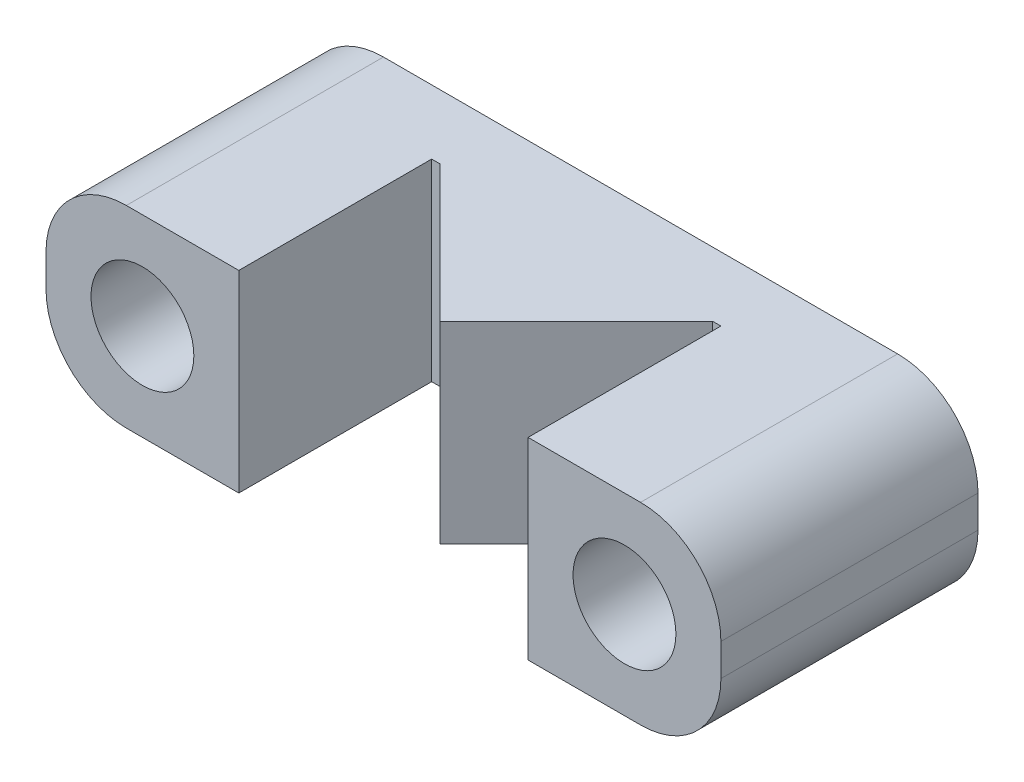
ISO-10303-21;
HEADER;
FILE_DESCRIPTION(('STEP AP214'),'2;1');
FILE_NAME('part.step','',(''),(''),'','','');
FILE_SCHEMA(('AUTOMOTIVE_DESIGN { 1 0 10303 214 1 1 1 1 }'));
ENDSEC;
DATA;
#1=APPLICATION_CONTEXT('core data for automotive mechanical design processes');
#2=APPLICATION_PROTOCOL_DEFINITION('international standard','automotive_design',2000,#1);
#3=PRODUCT_CONTEXT('',#1,'mechanical');
#4=PRODUCT('Part','Part','',(#3));
#5=PRODUCT_RELATED_PRODUCT_CATEGORY('part','',(#4));
#6=PRODUCT_DEFINITION_FORMATION('','',#4);
#7=PRODUCT_DEFINITION_CONTEXT('part definition',#1,'design');
#8=PRODUCT_DEFINITION('design','',#6,#7);
#9=PRODUCT_DEFINITION_SHAPE('','',#8);
#10=(LENGTH_UNIT() NAMED_UNIT(*) SI_UNIT(.MILLI.,.METRE.));
#11=(NAMED_UNIT(*) PLANE_ANGLE_UNIT() SI_UNIT($,.RADIAN.));
#12=(NAMED_UNIT(*) SI_UNIT($,.STERADIAN.) SOLID_ANGLE_UNIT());
#13=UNCERTAINTY_MEASURE_WITH_UNIT(LENGTH_MEASURE(1.E-05),#10,'distance_accuracy_value','');
#14=(GEOMETRIC_REPRESENTATION_CONTEXT(3) GLOBAL_UNCERTAINTY_ASSIGNED_CONTEXT((#13)) GLOBAL_UNIT_ASSIGNED_CONTEXT((#10,
#11,#12)) REPRESENTATION_CONTEXT('',''));
#15=CARTESIAN_POINT('',(0.,0.,0.));
#16=DIRECTION('',(0.,0.,1.));
#17=DIRECTION('',(1.,0.,0.));
#18=AXIS2_PLACEMENT_3D('',#15,#16,#17);
#19=CARTESIAN_POINT('',(3.,5.,2.));
#20=DIRECTION('',(0.,0.,-1.));
#21=DIRECTION('',(-1.,0.,0.));
#22=AXIS2_PLACEMENT_3D('',#19,#20,#21);
#23=PLANE('',#22);
#24=DIRECTION('',(1.,0.,0.));
#25=VECTOR('',#24,1.);
#26=CARTESIAN_POINT('',(3.,-3.,2.));
#27=LINE('',#26,#25);
#28=CARTESIAN_POINT('',(3.,-3.,2.));
#29=VERTEX_POINT('',#28);
#30=CARTESIAN_POINT('',(3.25735931288069,-3.,2.));
#31=VERTEX_POINT('',#30);
#32=EDGE_CURVE('E165',#29,#31,#27,.T.);
#33=ORIENTED_EDGE('',*,*,#32,.T.);
#34=DIRECTION('',(0.,-1.,0.));
#35=VECTOR('',#34,1.);
#36=CARTESIAN_POINT('',(3.25735931288069,12.4868329805051,2.));
#37=LINE('',#36,#35);
#38=CARTESIAN_POINT('',(3.25735931288069,3.,2.));
#39=VERTEX_POINT('',#38);
#40=EDGE_CURVE('E310',#39,#31,#37,.T.);
#41=ORIENTED_EDGE('',*,*,#40,.F.);
#42=DIRECTION('',(1.,0.,0.));
#43=VECTOR('',#42,1.);
#44=CARTESIAN_POINT('',(-0.499999999999983,3.,2.));
#45=LINE('',#44,#43);
#46=CARTESIAN_POINT('',(3.,3.,2.));
#47=VERTEX_POINT('',#46);
#48=EDGE_CURVE('E175',#47,#39,#45,.T.);
#49=ORIENTED_EDGE('',*,*,#48,.F.);
#50=DIRECTION('',(0.,-1.,0.));
#51=VECTOR('',#50,1.);
#52=CARTESIAN_POINT('',(3.,5.,2.));
#53=LINE('',#52,#51);
#54=EDGE_CURVE('E58',#47,#29,#53,.T.);
#55=ORIENTED_EDGE('',*,*,#54,.T.);
#56=EDGE_LOOP('',(#33,#41,#49,#55));
#57=FACE_BOUND('',#56,.T.);
#58=ADVANCED_FACE('F35',(#57),#23,.F.);
#59=CARTESIAN_POINT('',(15.5,-0.5,8.));
#60=DIRECTION('',(0.,0.,1.));
#61=DIRECTION('',(1.,0.,0.));
#62=AXIS2_PLACEMENT_3D('',#59,#60,#61);
#63=PLANE('',#62);
#64=DIRECTION('',(0.,-1.,0.));
#65=VECTOR('',#64,1.);
#66=CARTESIAN_POINT('',(3.,-0.5,8.));
#67=LINE('',#66,#65);
#68=CARTESIAN_POINT('',(3.,3.,8.));
#69=VERTEX_POINT('',#68);
#70=CARTESIAN_POINT('',(3.,-3.,8.));
#71=VERTEX_POINT('',#70);
#72=EDGE_CURVE('E186',#69,#71,#67,.T.);
#73=ORIENTED_EDGE('',*,*,#72,.F.);
#74=DIRECTION('',(-1.,0.,0.));
#75=VECTOR('',#74,1.);
#76=CARTESIAN_POINT('',(-0.499999999999983,3.,8.));
#77=LINE('',#76,#75);
#78=CARTESIAN_POINT('',(-0.499999999999983,3.,8.));
#79=VERTEX_POINT('',#78);
#80=EDGE_CURVE('E209',#69,#79,#77,.T.);
#81=ORIENTED_EDGE('',*,*,#80,.T.);
#82=CARTESIAN_POINT('',(-0.5,0.500000000000001,8.));
#83=DIRECTION('',(0.,0.,1.));
#84=DIRECTION('',(1.,0.,0.));
#85=AXIS2_PLACEMENT_3D('',#82,#83,#84);
#86=CIRCLE('',#85,2.5);
#87=CARTESIAN_POINT('',(-3.,0.499999999999983,8.));
#88=VERTEX_POINT('',#87);
#89=EDGE_CURVE('E213',#79,#88,#86,.T.);
#90=ORIENTED_EDGE('',*,*,#89,.T.);
#91=DIRECTION('',(0.,-1.,0.));
#92=VECTOR('',#91,1.);
#93=CARTESIAN_POINT('',(-3.,0.499999999999983,8.));
#94=LINE('',#93,#92);
#95=CARTESIAN_POINT('',(-3.,-0.499999999999982,8.));
#96=VERTEX_POINT('',#95);
#97=EDGE_CURVE('E215',#88,#96,#94,.T.);
#98=ORIENTED_EDGE('',*,*,#97,.T.);
#99=CARTESIAN_POINT('',(-0.5,-0.5,8.));
#100=DIRECTION('',(0.,0.,1.));
#101=DIRECTION('',(1.,0.,0.));
#102=AXIS2_PLACEMENT_3D('',#99,#100,#101);
#103=CIRCLE('',#102,2.5);
#104=CARTESIAN_POINT('',(-0.499999999999982,-3.,8.));
#105=VERTEX_POINT('',#104);
#106=EDGE_CURVE('E217',#96,#105,#103,.T.);
#107=ORIENTED_EDGE('',*,*,#106,.T.);
#108=DIRECTION('',(1.,0.,0.));
#109=VECTOR('',#108,1.);
#110=CARTESIAN_POINT('',(-0.499999999999982,-3.,8.));
#111=LINE('',#110,#109);
#112=EDGE_CURVE('E220',#105,#71,#111,.T.);
#113=ORIENTED_EDGE('',*,*,#112,.T.);
#114=EDGE_LOOP('',(#73,#81,#90,#98,#107,#113));
#115=FACE_BOUND('',#114,.T.);
#116=CARTESIAN_POINT('',(0.,0.,8.));
#117=DIRECTION('',(0.,0.,1.));
#118=DIRECTION('',(1.,0.,0.));
#119=AXIS2_PLACEMENT_3D('',#116,#117,#118);
#120=CIRCLE('',#119,1.6);
#121=CARTESIAN_POINT('',(1.6,0.,8.));
#122=VERTEX_POINT('',#121);
#123=EDGE_CURVE('E195',#122,#122,#120,.T.);
#124=ORIENTED_EDGE('',*,*,#123,.F.);
#125=EDGE_LOOP('',(#124));
#126=FACE_BOUND('',#125,.T.);
#127=ADVANCED_FACE('F305',(#115,#126),#63,.T.);
#128=DIRECTION('',(0.,1.,0.));
#129=VECTOR('',#128,1.);
#130=CARTESIAN_POINT('',(12.,-0.5,8.));
#131=LINE('',#130,#129);
#132=CARTESIAN_POINT('',(12.,-3.,8.));
#133=VERTEX_POINT('',#132);
#134=CARTESIAN_POINT('',(12.,3.,8.));
#135=VERTEX_POINT('',#134);
#136=EDGE_CURVE('E181',#133,#135,#131,.T.);
#137=ORIENTED_EDGE('',*,*,#136,.F.);
#138=CARTESIAN_POINT('',(15.5,-3.,8.));
#139=VERTEX_POINT('',#138);
#140=EDGE_CURVE('E219',#133,#139,#111,.T.);
#141=ORIENTED_EDGE('',*,*,#140,.T.);
#142=CARTESIAN_POINT('',(15.5,-0.5,8.));
#143=DIRECTION('',(0.,0.,1.));
#144=DIRECTION('',(1.,0.,0.));
#145=AXIS2_PLACEMENT_3D('',#142,#143,#144);
#146=CIRCLE('',#145,2.5);
#147=CARTESIAN_POINT('',(18.,-0.499999999999982,8.));
#148=VERTEX_POINT('',#147);
#149=EDGE_CURVE('E201',#139,#148,#146,.T.);
#150=ORIENTED_EDGE('',*,*,#149,.T.);
#151=DIRECTION('',(0.,1.,0.));
#152=VECTOR('',#151,1.);
#153=CARTESIAN_POINT('',(18.,0.499999999999983,8.));
#154=LINE('',#153,#152);
#155=CARTESIAN_POINT('',(18.,0.499999999999983,8.));
#156=VERTEX_POINT('',#155);
#157=EDGE_CURVE('E204',#148,#156,#154,.T.);
#158=ORIENTED_EDGE('',*,*,#157,.T.);
#159=CARTESIAN_POINT('',(15.5,0.5,8.));
#160=DIRECTION('',(0.,0.,1.));
#161=DIRECTION('',(-1.,0.,0.));
#162=AXIS2_PLACEMENT_3D('',#159,#160,#161);
#163=CIRCLE('',#162,2.5);
#164=CARTESIAN_POINT('',(15.5,3.,8.));
#165=VERTEX_POINT('',#164);
#166=EDGE_CURVE('E207',#156,#165,#163,.T.);
#167=ORIENTED_EDGE('',*,*,#166,.T.);
#168=EDGE_CURVE('E210',#165,#135,#77,.T.);
#169=ORIENTED_EDGE('',*,*,#168,.T.);
#170=EDGE_LOOP('',(#137,#141,#150,#158,#167,#169));
#171=FACE_BOUND('',#170,.T.);
#172=CARTESIAN_POINT('',(15.,0.,8.));
#173=DIRECTION('',(0.,0.,1.));
#174=DIRECTION('',(1.,0.,0.));
#175=AXIS2_PLACEMENT_3D('',#172,#173,#174);
#176=CIRCLE('',#175,1.6);
#177=CARTESIAN_POINT('',(16.6,0.,8.));
#178=VERTEX_POINT('',#177);
#179=EDGE_CURVE('E189',#178,#178,#176,.T.);
#180=ORIENTED_EDGE('',*,*,#179,.F.);
#181=EDGE_LOOP('',(#180));
#182=FACE_BOUND('',#181,.T.);
#183=ADVANCED_FACE('F287',(#171,#182),#63,.T.);
#184=CARTESIAN_POINT('',(15.5,-0.5,0.));
#185=DIRECTION('',(0.,0.,1.));
#186=DIRECTION('',(1.,0.,0.));
#187=AXIS2_PLACEMENT_3D('',#184,#185,#186);
#188=PLANE('',#187);
#189=CARTESIAN_POINT('',(15.5,-0.5,0.));
#190=DIRECTION('',(0.,0.,1.));
#191=DIRECTION('',(1.,0.,0.));
#192=AXIS2_PLACEMENT_3D('',#189,#190,#191);
#193=CIRCLE('',#192,2.5);
#194=CARTESIAN_POINT('',(15.5,-3.,0.));
#195=VERTEX_POINT('',#194);
#196=CARTESIAN_POINT('',(18.,-0.499999999999982,0.));
#197=VERTEX_POINT('',#196);
#198=EDGE_CURVE('E198',#195,#197,#193,.T.);
#199=ORIENTED_EDGE('',*,*,#198,.F.);
#200=DIRECTION('',(1.,0.,0.));
#201=VECTOR('',#200,1.);
#202=CARTESIAN_POINT('',(-0.499999999999982,-3.,0.));
#203=LINE('',#202,#201);
#204=CARTESIAN_POINT('',(-0.499999999999982,-3.,0.));
#205=VERTEX_POINT('',#204);
#206=EDGE_CURVE('E205',#205,#195,#203,.T.);
#207=ORIENTED_EDGE('',*,*,#206,.F.);
#208=CARTESIAN_POINT('',(-0.5,-0.5,0.));
#209=DIRECTION('',(0.,0.,1.));
#210=DIRECTION('',(1.,0.,0.));
#211=AXIS2_PLACEMENT_3D('',#208,#209,#210);
#212=CIRCLE('',#211,2.5);
#213=CARTESIAN_POINT('',(-3.,-0.499999999999982,0.));
#214=VERTEX_POINT('',#213);
#215=EDGE_CURVE('E236',#214,#205,#212,.T.);
#216=ORIENTED_EDGE('',*,*,#215,.F.);
#217=DIRECTION('',(0.,-1.,0.));
#218=VECTOR('',#217,1.);
#219=CARTESIAN_POINT('',(-3.,0.499999999999983,0.));
#220=LINE('',#219,#218);
#221=CARTESIAN_POINT('',(-3.,0.499999999999983,0.));
#222=VERTEX_POINT('',#221);
#223=EDGE_CURVE('E234',#222,#214,#220,.T.);
#224=ORIENTED_EDGE('',*,*,#223,.F.);
#225=CARTESIAN_POINT('',(-0.5,0.500000000000001,0.));
#226=DIRECTION('',(0.,0.,1.));
#227=DIRECTION('',(1.,0.,0.));
#228=AXIS2_PLACEMENT_3D('',#225,#226,#227);
#229=CIRCLE('',#228,2.5);
#230=CARTESIAN_POINT('',(-0.499999999999983,3.,0.));
#231=VERTEX_POINT('',#230);
#232=EDGE_CURVE('E232',#231,#222,#229,.T.);
#233=ORIENTED_EDGE('',*,*,#232,.F.);
#234=DIRECTION('',(-1.,0.,0.));
#235=VECTOR('',#234,1.);
#236=CARTESIAN_POINT('',(-0.499999999999983,3.,0.));
#237=LINE('',#236,#235);
#238=CARTESIAN_POINT('',(15.5,3.,0.));
#239=VERTEX_POINT('',#238);
#240=EDGE_CURVE('E230',#239,#231,#237,.T.);
#241=ORIENTED_EDGE('',*,*,#240,.F.);
#242=CARTESIAN_POINT('',(15.5,0.5,0.));
#243=DIRECTION('',(0.,0.,1.));
#244=DIRECTION('',(-1.,0.,0.));
#245=AXIS2_PLACEMENT_3D('',#242,#243,#244);
#246=CIRCLE('',#245,2.5);
#247=CARTESIAN_POINT('',(18.,0.499999999999983,0.));
#248=VERTEX_POINT('',#247);
#249=EDGE_CURVE('E228',#248,#239,#246,.T.);
#250=ORIENTED_EDGE('',*,*,#249,.F.);
#251=DIRECTION('',(0.,1.,0.));
#252=VECTOR('',#251,1.);
#253=CARTESIAN_POINT('',(18.,0.499999999999983,0.));
#254=LINE('',#253,#252);
#255=EDGE_CURVE('E226',#197,#248,#254,.T.);
#256=ORIENTED_EDGE('',*,*,#255,.F.);
#257=EDGE_LOOP('',(#199,#207,#216,#224,#233,#241,#250,#256));
#258=FACE_BOUND('',#257,.T.);
#259=CARTESIAN_POINT('',(0.,0.,0.));
#260=DIRECTION('',(0.,0.,1.));
#261=DIRECTION('',(1.,0.,0.));
#262=AXIS2_PLACEMENT_3D('',#259,#260,#261);
#263=CIRCLE('',#262,1.6);
#264=CARTESIAN_POINT('',(1.6,0.,0.));
#265=VERTEX_POINT('',#264);
#266=EDGE_CURVE('E192',#265,#265,#263,.T.);
#267=ORIENTED_EDGE('',*,*,#266,.T.);
#268=EDGE_LOOP('',(#267));
#269=FACE_BOUND('',#268,.T.);
#270=CARTESIAN_POINT('',(15.,0.,0.));
#271=DIRECTION('',(0.,0.,1.));
#272=DIRECTION('',(1.,0.,0.));
#273=AXIS2_PLACEMENT_3D('',#270,#271,#272);
#274=CIRCLE('',#273,1.6);
#275=CARTESIAN_POINT('',(16.6,0.,0.));
#276=VERTEX_POINT('',#275);
#277=EDGE_CURVE('E188',#276,#276,#274,.T.);
#278=ORIENTED_EDGE('',*,*,#277,.T.);
#279=EDGE_LOOP('',(#278));
#280=FACE_BOUND('',#279,.T.);
#281=ADVANCED_FACE('F269',(#258,#269,#280),#188,.F.);
#282=CARTESIAN_POINT('',(15.5,-0.5,8.));
#283=DIRECTION('',(0.,0.,-1.));
#284=DIRECTION('',(-1.,0.,0.));
#285=AXIS2_PLACEMENT_3D('',#282,#283,#284);
#286=CYLINDRICAL_SURFACE('',#285,2.5);
#287=ORIENTED_EDGE('',*,*,#198,.T.);
#288=DIRECTION('',(0.,0.,-1.));
#289=VECTOR('',#288,1.);
#290=CARTESIAN_POINT('',(18.,-0.499999999999982,8.));
#291=LINE('',#290,#289);
#292=EDGE_CURVE('E43',#148,#197,#291,.T.);
#293=ORIENTED_EDGE('',*,*,#292,.F.);
#294=ORIENTED_EDGE('',*,*,#149,.F.);
#295=DIRECTION('',(0.,0.,-1.));
#296=VECTOR('',#295,1.);
#297=CARTESIAN_POINT('',(15.5,-3.,8.));
#298=LINE('',#297,#296);
#299=EDGE_CURVE('E223',#139,#195,#298,.T.);
#300=ORIENTED_EDGE('',*,*,#299,.T.);
#301=EDGE_LOOP('',(#287,#293,#294,#300));
#302=FACE_BOUND('',#301,.T.);
#303=ADVANCED_FACE('F37',(#302),#286,.T.);
#304=CARTESIAN_POINT('',(18.,0.499999999999983,8.));
#305=DIRECTION('',(-1.,0.,0.));
#306=DIRECTION('',(0.,0.,1.));
#307=AXIS2_PLACEMENT_3D('',#304,#305,#306);
#308=PLANE('',#307);
#309=ORIENTED_EDGE('',*,*,#255,.T.);
#310=DIRECTION('',(0.,0.,-1.));
#311=VECTOR('',#310,1.);
#312=CARTESIAN_POINT('',(18.,0.499999999999983,8.));
#313=LINE('',#312,#311);
#314=EDGE_CURVE('E256',#156,#248,#313,.T.);
#315=ORIENTED_EDGE('',*,*,#314,.F.);
#316=ORIENTED_EDGE('',*,*,#157,.F.);
#317=ORIENTED_EDGE('',*,*,#292,.T.);
#318=EDGE_LOOP('',(#309,#315,#316,#317));
#319=FACE_BOUND('',#318,.T.);
#320=ADVANCED_FACE('F261',(#319),#308,.F.);
#321=CARTESIAN_POINT('',(15.5,0.5,8.));
#322=DIRECTION('',(0.,0.,-1.));
#323=DIRECTION('',(-1.,0.,0.));
#324=AXIS2_PLACEMENT_3D('',#321,#322,#323);
#325=CYLINDRICAL_SURFACE('',#324,2.5);
#326=ORIENTED_EDGE('',*,*,#249,.T.);
#327=DIRECTION('',(0.,0.,-1.));
#328=VECTOR('',#327,1.);
#329=CARTESIAN_POINT('',(15.5,3.,8.));
#330=LINE('',#329,#328);
#331=EDGE_CURVE('E253',#165,#239,#330,.T.);
#332=ORIENTED_EDGE('',*,*,#331,.F.);
#333=ORIENTED_EDGE('',*,*,#166,.F.);
#334=ORIENTED_EDGE('',*,*,#314,.T.);
#335=EDGE_LOOP('',(#326,#332,#333,#334));
#336=FACE_BOUND('',#335,.T.);
#337=ADVANCED_FACE('F277',(#336),#325,.T.);
#338=CARTESIAN_POINT('',(-0.499999999999983,3.,8.));
#339=DIRECTION('',(0.,-1.,0.));
#340=DIRECTION('',(0.,0.,-1.));
#341=AXIS2_PLACEMENT_3D('',#338,#339,#340);
#342=PLANE('',#341);
#343=ORIENTED_EDGE('',*,*,#80,.F.);
#344=DIRECTION('',(0.,0.,-1.));
#345=VECTOR('',#344,1.);
#346=CARTESIAN_POINT('',(3.,3.,8.));
#347=LINE('',#346,#345);
#348=EDGE_CURVE('E183',#69,#47,#347,.T.);
#349=ORIENTED_EDGE('',*,*,#348,.T.);
#350=ORIENTED_EDGE('',*,*,#48,.T.);
#351=DIRECTION('',(0.707106781186551,0.,0.707106781186544));
#352=VECTOR('',#351,1.);
#353=CARTESIAN_POINT('',(3.25735931288069,3.,2.));
#354=LINE('',#353,#352);
#355=CARTESIAN_POINT('',(7.5,3.,6.24264068711926));
#356=VERTEX_POINT('',#355);
#357=EDGE_CURVE('E168',#39,#356,#354,.T.);
#358=ORIENTED_EDGE('',*,*,#357,.T.);
#359=DIRECTION('',(0.707106781186542,0.,-0.707106781186554));
#360=VECTOR('',#359,1.);
#361=CARTESIAN_POINT('',(7.5,3.,6.24264068711926));
#362=LINE('',#361,#360);
#363=CARTESIAN_POINT('',(11.7426406871192,3.,2.));
#364=VERTEX_POINT('',#363);
#365=EDGE_CURVE('E166',#356,#364,#362,.T.);
#366=ORIENTED_EDGE('',*,*,#365,.T.);
#367=CARTESIAN_POINT('',(12.,3.,2.));
#368=VERTEX_POINT('',#367);
#369=EDGE_CURVE('E158',#364,#368,#45,.T.);
#370=ORIENTED_EDGE('',*,*,#369,.T.);
#371=DIRECTION('',(0.,0.,1.));
#372=VECTOR('',#371,1.);
#373=CARTESIAN_POINT('',(12.,3.,8.));
#374=LINE('',#373,#372);
#375=EDGE_CURVE('E178',#368,#135,#374,.T.);
#376=ORIENTED_EDGE('',*,*,#375,.T.);
#377=ORIENTED_EDGE('',*,*,#168,.F.);
#378=ORIENTED_EDGE('',*,*,#331,.T.);
#379=ORIENTED_EDGE('',*,*,#240,.T.);
#380=DIRECTION('',(0.,0.,-1.));
#381=VECTOR('',#380,1.);
#382=CARTESIAN_POINT('',(-0.499999999999983,3.,8.));
#383=LINE('',#382,#381);
#384=EDGE_CURVE('E250',#79,#231,#383,.T.);
#385=ORIENTED_EDGE('',*,*,#384,.F.);
#386=EDGE_LOOP('',(#343,#349,#350,#358,#366,#370,#376,#377,#378,#379,#385));
#387=FACE_BOUND('',#386,.T.);
#388=ADVANCED_FACE('F282',(#387),#342,.F.);
#389=CARTESIAN_POINT('',(-0.5,0.500000000000001,8.));
#390=DIRECTION('',(0.,0.,-1.));
#391=DIRECTION('',(-1.,0.,0.));
#392=AXIS2_PLACEMENT_3D('',#389,#390,#391);
#393=CYLINDRICAL_SURFACE('',#392,2.5);
#394=ORIENTED_EDGE('',*,*,#232,.T.);
#395=DIRECTION('',(0.,0.,-1.));
#396=VECTOR('',#395,1.);
#397=CARTESIAN_POINT('',(-3.,0.499999999999983,8.));
#398=LINE('',#397,#396);
#399=EDGE_CURVE('E247',#88,#222,#398,.T.);
#400=ORIENTED_EDGE('',*,*,#399,.F.);
#401=ORIENTED_EDGE('',*,*,#89,.F.);
#402=ORIENTED_EDGE('',*,*,#384,.T.);
#403=EDGE_LOOP('',(#394,#400,#401,#402));
#404=FACE_BOUND('',#403,.T.);
#405=ADVANCED_FACE('F302',(#404),#393,.T.);
#406=CARTESIAN_POINT('',(-3.,0.499999999999983,8.));
#407=DIRECTION('',(1.,0.,0.));
#408=DIRECTION('',(0.,0.,-1.));
#409=AXIS2_PLACEMENT_3D('',#406,#407,#408);
#410=PLANE('',#409);
#411=ORIENTED_EDGE('',*,*,#223,.T.);
#412=DIRECTION('',(0.,0.,-1.));
#413=VECTOR('',#412,1.);
#414=CARTESIAN_POINT('',(-3.,-0.499999999999982,8.));
#415=LINE('',#414,#413);
#416=EDGE_CURVE('E244',#96,#214,#415,.T.);
#417=ORIENTED_EDGE('',*,*,#416,.F.);
#418=ORIENTED_EDGE('',*,*,#97,.F.);
#419=ORIENTED_EDGE('',*,*,#399,.T.);
#420=EDGE_LOOP('',(#411,#417,#418,#419));
#421=FACE_BOUND('',#420,.T.);
#422=ADVANCED_FACE('F297',(#421),#410,.F.);
#423=CARTESIAN_POINT('',(-0.5,-0.5,8.));
#424=DIRECTION('',(0.,0.,-1.));
#425=DIRECTION('',(-1.,0.,0.));
#426=AXIS2_PLACEMENT_3D('',#423,#424,#425);
#427=CYLINDRICAL_SURFACE('',#426,2.5);
#428=ORIENTED_EDGE('',*,*,#215,.T.);
#429=DIRECTION('',(0.,0.,-1.));
#430=VECTOR('',#429,1.);
#431=CARTESIAN_POINT('',(-0.499999999999982,-3.,8.));
#432=LINE('',#431,#430);
#433=EDGE_CURVE('E241',#105,#205,#432,.T.);
#434=ORIENTED_EDGE('',*,*,#433,.F.);
#435=ORIENTED_EDGE('',*,*,#106,.F.);
#436=ORIENTED_EDGE('',*,*,#416,.T.);
#437=EDGE_LOOP('',(#428,#434,#435,#436));
#438=FACE_BOUND('',#437,.T.);
#439=ADVANCED_FACE('F293',(#438),#427,.T.);
#440=CARTESIAN_POINT('',(-0.499999999999982,-3.,8.));
#441=DIRECTION('',(0.,1.,0.));
#442=DIRECTION('',(0.,0.,1.));
#443=AXIS2_PLACEMENT_3D('',#440,#441,#442);
#444=PLANE('',#443);
#445=ORIENTED_EDGE('',*,*,#32,.F.);
#446=DIRECTION('',(0.,0.,1.));
#447=VECTOR('',#446,1.);
#448=CARTESIAN_POINT('',(3.,-3.,8.));
#449=LINE('',#448,#447);
#450=EDGE_CURVE('E12',#29,#71,#449,.T.);
#451=ORIENTED_EDGE('',*,*,#450,.T.);
#452=ORIENTED_EDGE('',*,*,#112,.F.);
#453=ORIENTED_EDGE('',*,*,#433,.T.);
#454=ORIENTED_EDGE('',*,*,#206,.T.);
#455=ORIENTED_EDGE('',*,*,#299,.F.);
#456=ORIENTED_EDGE('',*,*,#140,.F.);
#457=DIRECTION('',(0.,0.,1.));
#458=VECTOR('',#457,1.);
#459=CARTESIAN_POINT('',(12.,-3.,10.1997119874976));
#460=LINE('',#459,#458);
#461=CARTESIAN_POINT('',(12.,-3.,2.));
#462=VERTEX_POINT('',#461);
#463=EDGE_CURVE('E164',#462,#133,#460,.T.);
#464=ORIENTED_EDGE('',*,*,#463,.F.);
#465=CARTESIAN_POINT('',(11.7426406871192,-3.,2.));
#466=VERTEX_POINT('',#465);
#467=EDGE_CURVE('E156',#466,#462,#27,.T.);
#468=ORIENTED_EDGE('',*,*,#467,.F.);
#469=DIRECTION('',(-0.707106781186542,0.,0.707106781186554));
#470=VECTOR('',#469,1.);
#471=CARTESIAN_POINT('',(7.5,-3.,6.24264068711926));
#472=LINE('',#471,#470);
#473=CARTESIAN_POINT('',(7.5,-3.,6.24264068711926));
#474=VERTEX_POINT('',#473);
#475=EDGE_CURVE('E142',#466,#474,#472,.T.);
#476=ORIENTED_EDGE('',*,*,#475,.T.);
#477=DIRECTION('',(-0.707106781186551,0.,-0.707106781186544));
#478=VECTOR('',#477,1.);
#479=CARTESIAN_POINT('',(3.25735931288069,-3.,2.));
#480=LINE('',#479,#478);
#481=EDGE_CURVE('E150',#474,#31,#480,.T.);
#482=ORIENTED_EDGE('',*,*,#481,.T.);
#483=EDGE_LOOP('',(#445,#451,#452,#453,#454,#455,#456,#464,#468,#476,#482));
#484=FACE_BOUND('',#483,.T.);
#485=ADVANCED_FACE('F162',(#484),#444,.F.);
#486=CARTESIAN_POINT('',(0.,0.,8.));
#487=DIRECTION('',(0.,0.,-1.));
#488=DIRECTION('',(-1.,0.,0.));
#489=AXIS2_PLACEMENT_3D('',#486,#487,#488);
#490=CYLINDRICAL_SURFACE('',#489,1.6);
#491=ORIENTED_EDGE('',*,*,#123,.T.);
#492=EDGE_LOOP('',(#491));
#493=FACE_BOUND('',#492,.T.);
#494=ORIENTED_EDGE('',*,*,#266,.F.);
#495=EDGE_LOOP('',(#494));
#496=FACE_BOUND('',#495,.T.);
#497=ADVANCED_FACE('F340',(#493,#496),#490,.F.);
#498=CARTESIAN_POINT('',(15.,0.,8.));
#499=DIRECTION('',(0.,0.,-1.));
#500=DIRECTION('',(-1.,0.,0.));
#501=AXIS2_PLACEMENT_3D('',#498,#499,#500);
#502=CYLINDRICAL_SURFACE('',#501,1.6);
#503=ORIENTED_EDGE('',*,*,#179,.T.);
#504=EDGE_LOOP('',(#503));
#505=FACE_BOUND('',#504,.T.);
#506=ORIENTED_EDGE('',*,*,#277,.F.);
#507=EDGE_LOOP('',(#506));
#508=FACE_BOUND('',#507,.T.);
#509=ADVANCED_FACE('F335',(#505,#508),#502,.F.);
#510=ORIENTED_EDGE('',*,*,#369,.F.);
#511=DIRECTION('',(0.,-1.,0.));
#512=VECTOR('',#511,1.);
#513=CARTESIAN_POINT('',(11.7426406871192,12.4868329805051,2.));
#514=LINE('',#513,#512);
#515=EDGE_CURVE('E50',#364,#466,#514,.T.);
#516=ORIENTED_EDGE('',*,*,#515,.T.);
#517=ORIENTED_EDGE('',*,*,#467,.T.);
#518=DIRECTION('',(0.,-1.,0.));
#519=VECTOR('',#518,1.);
#520=CARTESIAN_POINT('',(12.,5.,2.));
#521=LINE('',#520,#519);
#522=EDGE_CURVE('E172',#368,#462,#521,.T.);
#523=ORIENTED_EDGE('',*,*,#522,.F.);
#524=EDGE_LOOP('',(#510,#516,#517,#523));
#525=FACE_BOUND('',#524,.T.);
#526=ADVANCED_FACE('F154',(#525),#23,.F.);
#527=CARTESIAN_POINT('',(3.,5.,10.1997119874976));
#528=DIRECTION('',(-1.,0.,0.));
#529=DIRECTION('',(0.,0.,1.));
#530=AXIS2_PLACEMENT_3D('',#527,#528,#529);
#531=PLANE('',#530);
#532=ORIENTED_EDGE('',*,*,#72,.T.);
#533=ORIENTED_EDGE('',*,*,#450,.F.);
#534=ORIENTED_EDGE('',*,*,#54,.F.);
#535=ORIENTED_EDGE('',*,*,#348,.F.);
#536=EDGE_LOOP('',(#532,#533,#534,#535));
#537=FACE_BOUND('',#536,.T.);
#538=ADVANCED_FACE('F308',(#537),#531,.F.);
#539=CARTESIAN_POINT('',(12.,5.,10.1997119874976));
#540=DIRECTION('',(1.,0.,0.));
#541=DIRECTION('',(0.,0.,-1.));
#542=AXIS2_PLACEMENT_3D('',#539,#540,#541);
#543=PLANE('',#542);
#544=ORIENTED_EDGE('',*,*,#136,.T.);
#545=ORIENTED_EDGE('',*,*,#375,.F.);
#546=ORIENTED_EDGE('',*,*,#522,.T.);
#547=ORIENTED_EDGE('',*,*,#463,.T.);
#548=EDGE_LOOP('',(#544,#545,#546,#547));
#549=FACE_BOUND('',#548,.T.);
#550=ADVANCED_FACE('F318',(#549),#543,.F.);
#551=CARTESIAN_POINT('',(3.25735931288069,12.4868329805051,2.));
#552=DIRECTION('',(-0.707106781186544,0.,0.707106781186551));
#553=DIRECTION('',(0.707106781186551,0.,0.707106781186544));
#554=AXIS2_PLACEMENT_3D('',#551,#552,#553);
#555=PLANE('',#554);
#556=ORIENTED_EDGE('',*,*,#357,.F.);
#557=ORIENTED_EDGE('',*,*,#40,.T.);
#558=ORIENTED_EDGE('',*,*,#481,.F.);
#559=DIRECTION('',(0.,-1.,0.));
#560=VECTOR('',#559,1.);
#561=CARTESIAN_POINT('',(7.5,12.4868329805051,6.24264068711926));
#562=LINE('',#561,#560);
#563=EDGE_CURVE('E145',#356,#474,#562,.T.);
#564=ORIENTED_EDGE('',*,*,#563,.F.);
#565=EDGE_LOOP('',(#556,#557,#558,#564));
#566=FACE_BOUND('',#565,.T.);
#567=ADVANCED_FACE('F314',(#566),#555,.T.);
#568=CARTESIAN_POINT('',(7.5,12.4868329805051,6.24264068711926));
#569=DIRECTION('',(0.707106781186554,0.,0.707106781186542));
#570=DIRECTION('',(0.707106781186542,0.,-0.707106781186554));
#571=AXIS2_PLACEMENT_3D('',#568,#569,#570);
#572=PLANE('',#571);
#573=ORIENTED_EDGE('',*,*,#365,.F.);
#574=ORIENTED_EDGE('',*,*,#563,.T.);
#575=ORIENTED_EDGE('',*,*,#475,.F.);
#576=ORIENTED_EDGE('',*,*,#515,.F.);
#577=EDGE_LOOP('',(#573,#574,#575,#576));
#578=FACE_BOUND('',#577,.T.);
#579=ADVANCED_FACE('F143',(#578),#572,.T.);
#580=CLOSED_SHELL('',(#58,#127,#183,#281,#303,#320,#337,#388,#405,#422,#439,#485,#497,#509,#526,
#538,#550,#567,#579));
#581=MANIFOLD_SOLID_BREP('B2',#580);
#582=ADVANCED_BREP_SHAPE_REPRESENTATION('',(#18,#581),#14);
#583=SHAPE_DEFINITION_REPRESENTATION(#9,#582);
ENDSEC;
END-ISO-10303-21;
